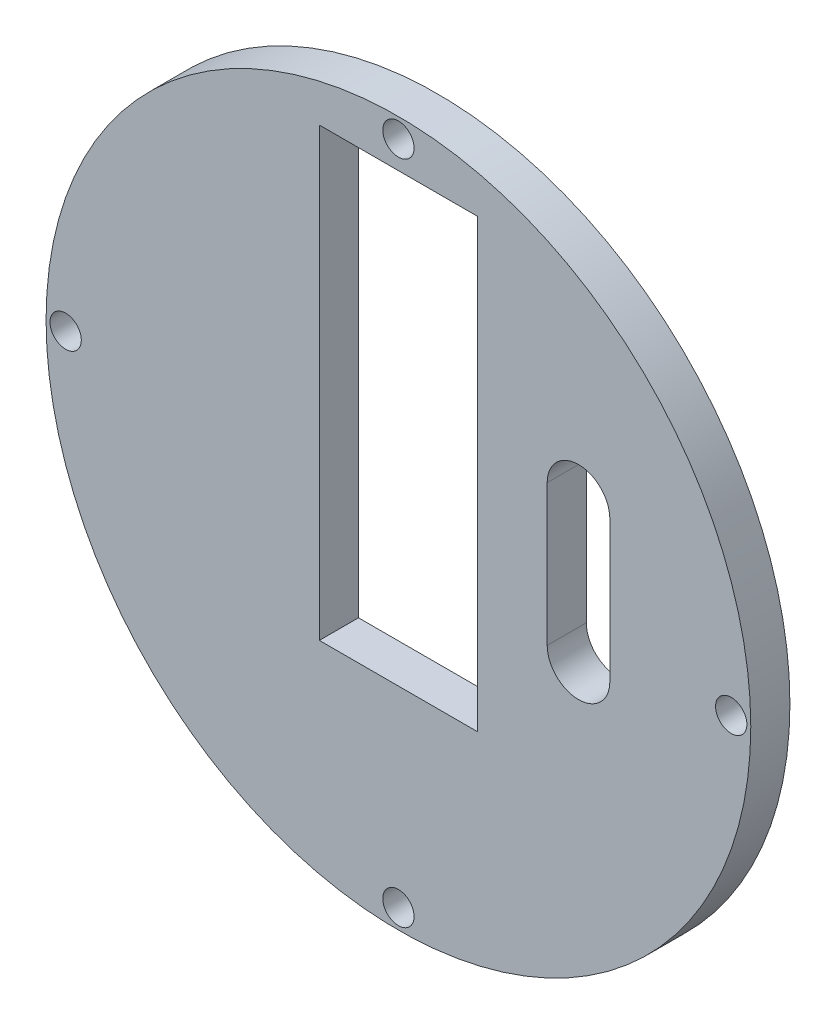
ISO-10303-21;
HEADER;
FILE_DESCRIPTION(('STEP AP214'),'2;1');
FILE_NAME('part.step','',(''),(''),'','','');
FILE_SCHEMA(('AUTOMOTIVE_DESIGN { 1 0 10303 214 1 1 1 1 }'));
ENDSEC;
DATA;
#1=APPLICATION_CONTEXT('core data for automotive mechanical design processes');
#2=APPLICATION_PROTOCOL_DEFINITION('international standard','automotive_design',2000,#1);
#3=PRODUCT_CONTEXT('',#1,'mechanical');
#4=PRODUCT('Part','Part','',(#3));
#5=PRODUCT_RELATED_PRODUCT_CATEGORY('part','',(#4));
#6=PRODUCT_DEFINITION_FORMATION('','',#4);
#7=PRODUCT_DEFINITION_CONTEXT('part definition',#1,'design');
#8=PRODUCT_DEFINITION('design','',#6,#7);
#9=PRODUCT_DEFINITION_SHAPE('','',#8);
#10=(LENGTH_UNIT() NAMED_UNIT(*) SI_UNIT(.MILLI.,.METRE.));
#11=(NAMED_UNIT(*) PLANE_ANGLE_UNIT() SI_UNIT($,.RADIAN.));
#12=(NAMED_UNIT(*) SI_UNIT($,.STERADIAN.) SOLID_ANGLE_UNIT());
#13=UNCERTAINTY_MEASURE_WITH_UNIT(LENGTH_MEASURE(1.E-05),#10,'distance_accuracy_value','');
#14=(GEOMETRIC_REPRESENTATION_CONTEXT(3) GLOBAL_UNCERTAINTY_ASSIGNED_CONTEXT((#13)) GLOBAL_UNIT_ASSIGNED_CONTEXT((#10,
#11,#12)) REPRESENTATION_CONTEXT('',''));
#15=CARTESIAN_POINT('',(0.,0.,0.));
#16=DIRECTION('',(0.,0.,1.));
#17=DIRECTION('',(1.,0.,0.));
#18=AXIS2_PLACEMENT_3D('',#15,#16,#17);
#19=CARTESIAN_POINT('',(0.,39.,5.));
#20=DIRECTION('',(0.,1.,0.));
#21=DIRECTION('',(0.,0.,1.));
#22=AXIS2_PLACEMENT_3D('',#19,#20,#21);
#23=PLANE('',#22);
#24=DIRECTION('',(1.,0.,0.));
#25=VECTOR('',#24,1.);
#26=CARTESIAN_POINT('',(0.,39.,0.));
#27=LINE('',#26,#25);
#28=CARTESIAN_POINT('',(-10.1,39.,0.));
#29=VERTEX_POINT('',#28);
#30=CARTESIAN_POINT('',(10.1,39.,0.));
#31=VERTEX_POINT('',#30);
#32=EDGE_CURVE('E186',#29,#31,#27,.T.);
#33=ORIENTED_EDGE('',*,*,#32,.T.);
#34=DIRECTION('',(0.,0.,-1.));
#35=VECTOR('',#34,1.);
#36=CARTESIAN_POINT('',(10.1,39.,5.));
#37=LINE('',#36,#35);
#38=CARTESIAN_POINT('',(10.1,39.,5.));
#39=VERTEX_POINT('',#38);
#40=EDGE_CURVE('E13',#39,#31,#37,.T.);
#41=ORIENTED_EDGE('',*,*,#40,.F.);
#42=DIRECTION('',(1.,0.,0.));
#43=VECTOR('',#42,1.);
#44=CARTESIAN_POINT('',(0.,39.,5.));
#45=LINE('',#44,#43);
#46=CARTESIAN_POINT('',(-10.1,39.,5.));
#47=VERTEX_POINT('',#46);
#48=EDGE_CURVE('E160',#47,#39,#45,.T.);
#49=ORIENTED_EDGE('',*,*,#48,.F.);
#50=DIRECTION('',(0.,0.,-1.));
#51=VECTOR('',#50,1.);
#52=CARTESIAN_POINT('',(-10.1,39.,5.));
#53=LINE('',#52,#51);
#54=EDGE_CURVE('E174',#47,#29,#53,.T.);
#55=ORIENTED_EDGE('',*,*,#54,.T.);
#56=EDGE_LOOP('',(#33,#41,#49,#55));
#57=FACE_BOUND('',#56,.T.);
#58=ADVANCED_FACE('F46',(#57),#23,.F.);
#59=CARTESIAN_POINT('',(10.1,0.,5.));
#60=DIRECTION('',(1.,0.,0.));
#61=DIRECTION('',(0.,1.,0.));
#62=AXIS2_PLACEMENT_3D('',#59,#60,#61);
#63=PLANE('',#62);
#64=DIRECTION('',(0.,-1.,0.));
#65=VECTOR('',#64,1.);
#66=CARTESIAN_POINT('',(10.1,0.,0.));
#67=LINE('',#66,#65);
#68=CARTESIAN_POINT('',(10.1,-18.,0.));
#69=VERTEX_POINT('',#68);
#70=EDGE_CURVE('E189',#31,#69,#67,.T.);
#71=ORIENTED_EDGE('',*,*,#70,.T.);
#72=DIRECTION('',(0.,0.,-1.));
#73=VECTOR('',#72,1.);
#74=CARTESIAN_POINT('',(10.1,-18.,5.));
#75=LINE('',#74,#73);
#76=CARTESIAN_POINT('',(10.1,-18.,5.));
#77=VERTEX_POINT('',#76);
#78=EDGE_CURVE('E54',#77,#69,#75,.T.);
#79=ORIENTED_EDGE('',*,*,#78,.F.);
#80=DIRECTION('',(0.,-1.,0.));
#81=VECTOR('',#80,1.);
#82=CARTESIAN_POINT('',(10.1,0.,5.));
#83=LINE('',#82,#81);
#84=EDGE_CURVE('E163',#39,#77,#83,.T.);
#85=ORIENTED_EDGE('',*,*,#84,.F.);
#86=ORIENTED_EDGE('',*,*,#40,.T.);
#87=EDGE_LOOP('',(#71,#79,#85,#86));
#88=FACE_BOUND('',#87,.T.);
#89=ADVANCED_FACE('F208',(#88),#63,.F.);
#90=CARTESIAN_POINT('',(0.,-18.,5.));
#91=DIRECTION('',(0.,1.,0.));
#92=DIRECTION('',(-1.,0.,0.));
#93=AXIS2_PLACEMENT_3D('',#90,#91,#92);
#94=PLANE('',#93);
#95=DIRECTION('',(1.,0.,0.));
#96=VECTOR('',#95,1.);
#97=CARTESIAN_POINT('',(0.,-18.,0.));
#98=LINE('',#97,#96);
#99=CARTESIAN_POINT('',(-10.1,-18.,0.));
#100=VERTEX_POINT('',#99);
#101=EDGE_CURVE('E192',#100,#69,#98,.T.);
#102=ORIENTED_EDGE('',*,*,#101,.F.);
#103=DIRECTION('',(0.,0.,-1.));
#104=VECTOR('',#103,1.);
#105=CARTESIAN_POINT('',(-10.1,-18.,5.));
#106=LINE('',#105,#104);
#107=CARTESIAN_POINT('',(-10.1,-18.,5.));
#108=VERTEX_POINT('',#107);
#109=EDGE_CURVE('E201',#108,#100,#106,.T.);
#110=ORIENTED_EDGE('',*,*,#109,.F.);
#111=DIRECTION('',(1.,0.,0.));
#112=VECTOR('',#111,1.);
#113=CARTESIAN_POINT('',(0.,-18.,5.));
#114=LINE('',#113,#112);
#115=EDGE_CURVE('E165',#108,#77,#114,.T.);
#116=ORIENTED_EDGE('',*,*,#115,.T.);
#117=ORIENTED_EDGE('',*,*,#78,.T.);
#118=EDGE_LOOP('',(#102,#110,#116,#117));
#119=FACE_BOUND('',#118,.T.);
#120=ADVANCED_FACE('F205',(#119),#94,.T.);
#121=CARTESIAN_POINT('',(-10.1,0.,5.));
#122=DIRECTION('',(1.,0.,0.));
#123=DIRECTION('',(0.,1.,0.));
#124=AXIS2_PLACEMENT_3D('',#121,#122,#123);
#125=PLANE('',#124);
#126=DIRECTION('',(0.,-1.,0.));
#127=VECTOR('',#126,1.);
#128=CARTESIAN_POINT('',(-10.1,0.,0.));
#129=LINE('',#128,#127);
#130=EDGE_CURVE('E195',#29,#100,#129,.T.);
#131=ORIENTED_EDGE('',*,*,#130,.F.);
#132=ORIENTED_EDGE('',*,*,#54,.F.);
#133=DIRECTION('',(0.,-1.,0.));
#134=VECTOR('',#133,1.);
#135=CARTESIAN_POINT('',(-10.1,0.,5.));
#136=LINE('',#135,#134);
#137=EDGE_CURVE('E168',#47,#108,#136,.T.);
#138=ORIENTED_EDGE('',*,*,#137,.T.);
#139=ORIENTED_EDGE('',*,*,#109,.T.);
#140=EDGE_LOOP('',(#131,#132,#138,#139));
#141=FACE_BOUND('',#140,.T.);
#142=ADVANCED_FACE('F215',(#141),#125,.T.);
#143=CARTESIAN_POINT('',(42.5,0.,5.));
#144=DIRECTION('',(0.,0.,-1.));
#145=DIRECTION('',(-1.,0.,0.));
#146=AXIS2_PLACEMENT_3D('',#143,#144,#145);
#147=CYLINDRICAL_SURFACE('',#146,2.);
#148=CARTESIAN_POINT('',(42.5,0.,5.));
#149=DIRECTION('',(0.,0.,1.));
#150=DIRECTION('',(1.,0.,0.));
#151=AXIS2_PLACEMENT_3D('',#148,#149,#150);
#152=CIRCLE('',#151,2.);
#153=CARTESIAN_POINT('',(44.5,0.,5.));
#154=VERTEX_POINT('',#153);
#155=EDGE_CURVE('E157',#154,#154,#152,.T.);
#156=ORIENTED_EDGE('',*,*,#155,.T.);
#157=EDGE_LOOP('',(#156));
#158=FACE_BOUND('',#157,.T.);
#159=CARTESIAN_POINT('',(42.5,0.,0.));
#160=DIRECTION('',(0.,0.,1.));
#161=DIRECTION('',(1.,0.,0.));
#162=AXIS2_PLACEMENT_3D('',#159,#160,#161);
#163=CIRCLE('',#162,2.);
#164=CARTESIAN_POINT('',(44.5,0.,0.));
#165=VERTEX_POINT('',#164);
#166=EDGE_CURVE('E183',#165,#165,#163,.T.);
#167=ORIENTED_EDGE('',*,*,#166,.F.);
#168=EDGE_LOOP('',(#167));
#169=FACE_BOUND('',#168,.T.);
#170=ADVANCED_FACE('F230',(#158,#169),#147,.F.);
#171=CARTESIAN_POINT('',(0.,-42.5,5.));
#172=DIRECTION('',(0.,0.,-1.));
#173=DIRECTION('',(-1.,0.,0.));
#174=AXIS2_PLACEMENT_3D('',#171,#172,#173);
#175=CYLINDRICAL_SURFACE('',#174,2.);
#176=CARTESIAN_POINT('',(0.,-42.5,5.));
#177=DIRECTION('',(0.,0.,1.));
#178=DIRECTION('',(1.,0.,0.));
#179=AXIS2_PLACEMENT_3D('',#176,#177,#178);
#180=CIRCLE('',#179,2.);
#181=CARTESIAN_POINT('',(2.00000000000001,-42.5,5.));
#182=VERTEX_POINT('',#181);
#183=EDGE_CURVE('E154',#182,#182,#180,.T.);
#184=ORIENTED_EDGE('',*,*,#183,.T.);
#185=EDGE_LOOP('',(#184));
#186=FACE_BOUND('',#185,.T.);
#187=CARTESIAN_POINT('',(0.,-42.5,0.));
#188=DIRECTION('',(0.,0.,1.));
#189=DIRECTION('',(1.,0.,0.));
#190=AXIS2_PLACEMENT_3D('',#187,#188,#189);
#191=CIRCLE('',#190,2.);
#192=CARTESIAN_POINT('',(2.00000000000001,-42.5,0.));
#193=VERTEX_POINT('',#192);
#194=EDGE_CURVE('E180',#193,#193,#191,.T.);
#195=ORIENTED_EDGE('',*,*,#194,.F.);
#196=EDGE_LOOP('',(#195));
#197=FACE_BOUND('',#196,.T.);
#198=ADVANCED_FACE('F233',(#186,#197),#175,.F.);
#199=CARTESIAN_POINT('',(-42.5,0.,5.));
#200=DIRECTION('',(0.,0.,-1.));
#201=DIRECTION('',(-1.,0.,0.));
#202=AXIS2_PLACEMENT_3D('',#199,#200,#201);
#203=CYLINDRICAL_SURFACE('',#202,2.);
#204=CARTESIAN_POINT('',(-42.5,0.,5.));
#205=DIRECTION('',(0.,0.,1.));
#206=DIRECTION('',(1.,0.,0.));
#207=AXIS2_PLACEMENT_3D('',#204,#205,#206);
#208=CIRCLE('',#207,2.);
#209=CARTESIAN_POINT('',(-40.5,0.,5.));
#210=VERTEX_POINT('',#209);
#211=EDGE_CURVE('E150',#210,#210,#208,.T.);
#212=ORIENTED_EDGE('',*,*,#211,.T.);
#213=EDGE_LOOP('',(#212));
#214=FACE_BOUND('',#213,.T.);
#215=CARTESIAN_POINT('',(-42.5,0.,0.));
#216=DIRECTION('',(0.,0.,1.));
#217=DIRECTION('',(1.,0.,0.));
#218=AXIS2_PLACEMENT_3D('',#215,#216,#217);
#219=CIRCLE('',#218,2.);
#220=CARTESIAN_POINT('',(-40.5,0.,0.));
#221=VERTEX_POINT('',#220);
#222=EDGE_CURVE('E177',#221,#221,#219,.T.);
#223=ORIENTED_EDGE('',*,*,#222,.F.);
#224=EDGE_LOOP('',(#223));
#225=FACE_BOUND('',#224,.T.);
#226=ADVANCED_FACE('F236',(#214,#225),#203,.F.);
#227=CARTESIAN_POINT('',(0.,42.5,5.));
#228=DIRECTION('',(0.,0.,-1.));
#229=DIRECTION('',(-1.,0.,0.));
#230=AXIS2_PLACEMENT_3D('',#227,#228,#229);
#231=CYLINDRICAL_SURFACE('',#230,2.);
#232=CARTESIAN_POINT('',(0.,42.5,5.));
#233=DIRECTION('',(0.,0.,1.));
#234=DIRECTION('',(1.,0.,0.));
#235=AXIS2_PLACEMENT_3D('',#232,#233,#234);
#236=CIRCLE('',#235,2.);
#237=CARTESIAN_POINT('',(1.99999999999999,42.5,5.));
#238=VERTEX_POINT('',#237);
#239=EDGE_CURVE('E147',#238,#238,#236,.T.);
#240=ORIENTED_EDGE('',*,*,#239,.T.);
#241=EDGE_LOOP('',(#240));
#242=FACE_BOUND('',#241,.T.);
#243=CARTESIAN_POINT('',(0.,42.5,0.));
#244=DIRECTION('',(0.,0.,1.));
#245=DIRECTION('',(1.,0.,0.));
#246=AXIS2_PLACEMENT_3D('',#243,#244,#245);
#247=CIRCLE('',#246,2.);
#248=CARTESIAN_POINT('',(1.99999999999999,42.5,0.));
#249=VERTEX_POINT('',#248);
#250=EDGE_CURVE('E146',#249,#249,#247,.T.);
#251=ORIENTED_EDGE('',*,*,#250,.F.);
#252=EDGE_LOOP('',(#251));
#253=FACE_BOUND('',#252,.T.);
#254=ADVANCED_FACE('F48',(#242,#253),#231,.F.);
#255=CARTESIAN_POINT('',(0.,0.,5.));
#256=DIRECTION('',(0.,0.,-1.));
#257=DIRECTION('',(-1.,0.,0.));
#258=AXIS2_PLACEMENT_3D('',#255,#256,#257);
#259=CYLINDRICAL_SURFACE('',#258,45.);
#260=CARTESIAN_POINT('',(0.,0.,5.));
#261=DIRECTION('',(0.,0.,1.));
#262=DIRECTION('',(1.,0.,0.));
#263=AXIS2_PLACEMENT_3D('',#260,#261,#262);
#264=CIRCLE('',#263,45.);
#265=CARTESIAN_POINT('',(45.,0.,5.));
#266=VERTEX_POINT('',#265);
#267=EDGE_CURVE('E171',#266,#266,#264,.T.);
#268=ORIENTED_EDGE('',*,*,#267,.F.);
#269=EDGE_LOOP('',(#268));
#270=FACE_BOUND('',#269,.T.);
#271=CARTESIAN_POINT('',(0.,0.,0.));
#272=DIRECTION('',(0.,0.,1.));
#273=DIRECTION('',(1.,0.,0.));
#274=AXIS2_PLACEMENT_3D('',#271,#272,#273);
#275=CIRCLE('',#274,45.);
#276=CARTESIAN_POINT('',(45.,0.,0.));
#277=VERTEX_POINT('',#276);
#278=EDGE_CURVE('E151',#277,#277,#275,.T.);
#279=ORIENTED_EDGE('',*,*,#278,.T.);
#280=EDGE_LOOP('',(#279));
#281=FACE_BOUND('',#280,.T.);
#282=ADVANCED_FACE('F243',(#270,#281),#259,.T.);
#283=CARTESIAN_POINT('',(0.,0.,5.));
#284=DIRECTION('',(0.,0.,1.));
#285=DIRECTION('',(1.,0.,0.));
#286=AXIS2_PLACEMENT_3D('',#283,#284,#285);
#287=PLANE('',#286);
#288=CARTESIAN_POINT('',(23.,14.,5.));
#289=DIRECTION('',(0.,0.,1.));
#290=DIRECTION('',(1.,0.,0.));
#291=AXIS2_PLACEMENT_3D('',#288,#289,#290);
#292=CIRCLE('',#291,4.00000000000001);
#293=CARTESIAN_POINT('',(27.,14.,5.));
#294=VERTEX_POINT('',#293);
#295=CARTESIAN_POINT('',(19.,14.,5.));
#296=VERTEX_POINT('',#295);
#297=EDGE_CURVE('E144',#294,#296,#292,.T.);
#298=ORIENTED_EDGE('',*,*,#297,.F.);
#299=DIRECTION('',(0.,1.,0.));
#300=VECTOR('',#299,1.);
#301=CARTESIAN_POINT('',(27.,0.,5.));
#302=LINE('',#301,#300);
#303=CARTESIAN_POINT('',(27.,-4.,5.));
#304=VERTEX_POINT('',#303);
#305=EDGE_CURVE('E137',#304,#294,#302,.T.);
#306=ORIENTED_EDGE('',*,*,#305,.F.);
#307=CARTESIAN_POINT('',(23.,-4.,5.));
#308=DIRECTION('',(0.,0.,1.));
#309=DIRECTION('',(1.,0.,0.));
#310=AXIS2_PLACEMENT_3D('',#307,#308,#309);
#311=CIRCLE('',#310,4.00000000000001);
#312=CARTESIAN_POINT('',(19.,-4.,5.));
#313=VERTEX_POINT('',#312);
#314=EDGE_CURVE('E117',#313,#304,#311,.T.);
#315=ORIENTED_EDGE('',*,*,#314,.F.);
#316=DIRECTION('',(0.,-1.,0.));
#317=VECTOR('',#316,1.);
#318=CARTESIAN_POINT('',(19.,0.,5.));
#319=LINE('',#318,#317);
#320=EDGE_CURVE('E142',#296,#313,#319,.T.);
#321=ORIENTED_EDGE('',*,*,#320,.F.);
#322=EDGE_LOOP('',(#298,#306,#315,#321));
#323=FACE_BOUND('',#322,.T.);
#324=ORIENTED_EDGE('',*,*,#239,.F.);
#325=EDGE_LOOP('',(#324));
#326=FACE_BOUND('',#325,.T.);
#327=ORIENTED_EDGE('',*,*,#211,.F.);
#328=EDGE_LOOP('',(#327));
#329=FACE_BOUND('',#328,.T.);
#330=ORIENTED_EDGE('',*,*,#183,.F.);
#331=EDGE_LOOP('',(#330));
#332=FACE_BOUND('',#331,.T.);
#333=ORIENTED_EDGE('',*,*,#155,.F.);
#334=EDGE_LOOP('',(#333));
#335=FACE_BOUND('',#334,.T.);
#336=ORIENTED_EDGE('',*,*,#48,.T.);
#337=ORIENTED_EDGE('',*,*,#84,.T.);
#338=ORIENTED_EDGE('',*,*,#115,.F.);
#339=ORIENTED_EDGE('',*,*,#137,.F.);
#340=EDGE_LOOP('',(#336,#337,#338,#339));
#341=FACE_BOUND('',#340,.T.);
#342=ORIENTED_EDGE('',*,*,#267,.T.);
#343=EDGE_LOOP('',(#342));
#344=FACE_BOUND('',#343,.T.);
#345=ADVANCED_FACE('F219',(#323,#326,#329,#332,#335,#341,#344),#287,.T.);
#346=CARTESIAN_POINT('',(0.,0.,0.));
#347=DIRECTION('',(0.,0.,1.));
#348=DIRECTION('',(1.,0.,0.));
#349=AXIS2_PLACEMENT_3D('',#346,#347,#348);
#350=PLANE('',#349);
#351=DIRECTION('',(0.,-1.,0.));
#352=VECTOR('',#351,1.);
#353=CARTESIAN_POINT('',(27.,14.,0.));
#354=LINE('',#353,#352);
#355=CARTESIAN_POINT('',(27.,14.,0.));
#356=VERTEX_POINT('',#355);
#357=CARTESIAN_POINT('',(27.,-4.,0.));
#358=VERTEX_POINT('',#357);
#359=EDGE_CURVE('E123',#356,#358,#354,.T.);
#360=ORIENTED_EDGE('',*,*,#359,.F.);
#361=CARTESIAN_POINT('',(23.,14.,0.));
#362=DIRECTION('',(0.,0.,-1.));
#363=DIRECTION('',(-1.,0.,0.));
#364=AXIS2_PLACEMENT_3D('',#361,#362,#363);
#365=CIRCLE('',#364,4.00000000000001);
#366=CARTESIAN_POINT('',(19.,14.,0.));
#367=VERTEX_POINT('',#366);
#368=EDGE_CURVE('E69',#367,#356,#365,.T.);
#369=ORIENTED_EDGE('',*,*,#368,.F.);
#370=DIRECTION('',(0.,1.,0.));
#371=VECTOR('',#370,1.);
#372=CARTESIAN_POINT('',(19.,14.,0.));
#373=LINE('',#372,#371);
#374=CARTESIAN_POINT('',(19.,-4.,0.));
#375=VERTEX_POINT('',#374);
#376=EDGE_CURVE('E130',#375,#367,#373,.T.);
#377=ORIENTED_EDGE('',*,*,#376,.F.);
#378=CARTESIAN_POINT('',(23.,-4.,0.));
#379=DIRECTION('',(0.,0.,-1.));
#380=DIRECTION('',(-1.,0.,0.));
#381=AXIS2_PLACEMENT_3D('',#378,#379,#380);
#382=CIRCLE('',#381,4.00000000000001);
#383=EDGE_CURVE('E114',#358,#375,#382,.T.);
#384=ORIENTED_EDGE('',*,*,#383,.F.);
#385=EDGE_LOOP('',(#360,#369,#377,#384));
#386=FACE_BOUND('',#385,.T.);
#387=ORIENTED_EDGE('',*,*,#250,.T.);
#388=EDGE_LOOP('',(#387));
#389=FACE_BOUND('',#388,.T.);
#390=ORIENTED_EDGE('',*,*,#222,.T.);
#391=EDGE_LOOP('',(#390));
#392=FACE_BOUND('',#391,.T.);
#393=ORIENTED_EDGE('',*,*,#194,.T.);
#394=EDGE_LOOP('',(#393));
#395=FACE_BOUND('',#394,.T.);
#396=ORIENTED_EDGE('',*,*,#166,.T.);
#397=EDGE_LOOP('',(#396));
#398=FACE_BOUND('',#397,.T.);
#399=ORIENTED_EDGE('',*,*,#32,.F.);
#400=ORIENTED_EDGE('',*,*,#130,.T.);
#401=ORIENTED_EDGE('',*,*,#101,.T.);
#402=ORIENTED_EDGE('',*,*,#70,.F.);
#403=EDGE_LOOP('',(#399,#400,#401,#402));
#404=FACE_BOUND('',#403,.T.);
#405=ORIENTED_EDGE('',*,*,#278,.F.);
#406=EDGE_LOOP('',(#405));
#407=FACE_BOUND('',#406,.T.);
#408=ADVANCED_FACE('F127',(#386,#389,#392,#395,#398,#404,#407),#350,.F.);
#409=CARTESIAN_POINT('',(23.,14.,10.));
#410=DIRECTION('',(0.,0.,-1.));
#411=DIRECTION('',(-1.,0.,0.));
#412=AXIS2_PLACEMENT_3D('',#409,#410,#411);
#413=CYLINDRICAL_SURFACE('',#412,4.00000000000001);
#414=ORIENTED_EDGE('',*,*,#297,.T.);
#415=DIRECTION('',(0.,0.,-1.));
#416=VECTOR('',#415,1.);
#417=CARTESIAN_POINT('',(19.,14.,10.));
#418=LINE('',#417,#416);
#419=EDGE_CURVE('E135',#296,#367,#418,.T.);
#420=ORIENTED_EDGE('',*,*,#419,.T.);
#421=ORIENTED_EDGE('',*,*,#368,.T.);
#422=DIRECTION('',(0.,0.,-1.));
#423=VECTOR('',#422,1.);
#424=CARTESIAN_POINT('',(27.,14.,10.));
#425=LINE('',#424,#423);
#426=EDGE_CURVE('E120',#294,#356,#425,.T.);
#427=ORIENTED_EDGE('',*,*,#426,.F.);
#428=EDGE_LOOP('',(#414,#420,#421,#427));
#429=FACE_BOUND('',#428,.T.);
#430=ADVANCED_FACE('F251',(#429),#413,.F.);
#431=CARTESIAN_POINT('',(19.,14.,10.));
#432=DIRECTION('',(-1.,0.,0.));
#433=DIRECTION('',(0.,0.,1.));
#434=AXIS2_PLACEMENT_3D('',#431,#432,#433);
#435=PLANE('',#434);
#436=ORIENTED_EDGE('',*,*,#320,.T.);
#437=DIRECTION('',(0.,0.,-1.));
#438=VECTOR('',#437,1.);
#439=CARTESIAN_POINT('',(19.,-4.,10.));
#440=LINE('',#439,#438);
#441=EDGE_CURVE('E119',#313,#375,#440,.T.);
#442=ORIENTED_EDGE('',*,*,#441,.T.);
#443=ORIENTED_EDGE('',*,*,#376,.T.);
#444=ORIENTED_EDGE('',*,*,#419,.F.);
#445=EDGE_LOOP('',(#436,#442,#443,#444));
#446=FACE_BOUND('',#445,.T.);
#447=ADVANCED_FACE('F263',(#446),#435,.F.);
#448=CARTESIAN_POINT('',(23.,-4.,10.));
#449=DIRECTION('',(0.,0.,-1.));
#450=DIRECTION('',(-1.,0.,0.));
#451=AXIS2_PLACEMENT_3D('',#448,#449,#450);
#452=CYLINDRICAL_SURFACE('',#451,4.00000000000001);
#453=ORIENTED_EDGE('',*,*,#314,.T.);
#454=DIRECTION('',(0.,0.,-1.));
#455=VECTOR('',#454,1.);
#456=CARTESIAN_POINT('',(27.,-4.,10.));
#457=LINE('',#456,#455);
#458=EDGE_CURVE('E61',#304,#358,#457,.T.);
#459=ORIENTED_EDGE('',*,*,#458,.T.);
#460=ORIENTED_EDGE('',*,*,#383,.T.);
#461=ORIENTED_EDGE('',*,*,#441,.F.);
#462=EDGE_LOOP('',(#453,#459,#460,#461));
#463=FACE_BOUND('',#462,.T.);
#464=ADVANCED_FACE('F111',(#463),#452,.F.);
#465=CARTESIAN_POINT('',(27.,14.,10.));
#466=DIRECTION('',(1.,0.,0.));
#467=DIRECTION('',(0.,0.,-1.));
#468=AXIS2_PLACEMENT_3D('',#465,#466,#467);
#469=PLANE('',#468);
#470=ORIENTED_EDGE('',*,*,#305,.T.);
#471=ORIENTED_EDGE('',*,*,#426,.T.);
#472=ORIENTED_EDGE('',*,*,#359,.T.);
#473=ORIENTED_EDGE('',*,*,#458,.F.);
#474=EDGE_LOOP('',(#470,#471,#472,#473));
#475=FACE_BOUND('',#474,.T.);
#476=ADVANCED_FACE('F124',(#475),#469,.F.);
#477=CLOSED_SHELL('',(#58,#89,#120,#142,#170,#198,#226,#254,#282,#345,#408,#430,#447,#464,#476));
#478=MANIFOLD_SOLID_BREP('B2',#477);
#479=ADVANCED_BREP_SHAPE_REPRESENTATION('',(#18,#478),#14);
#480=SHAPE_DEFINITION_REPRESENTATION(#9,#479);
ENDSEC;
END-ISO-10303-21;
